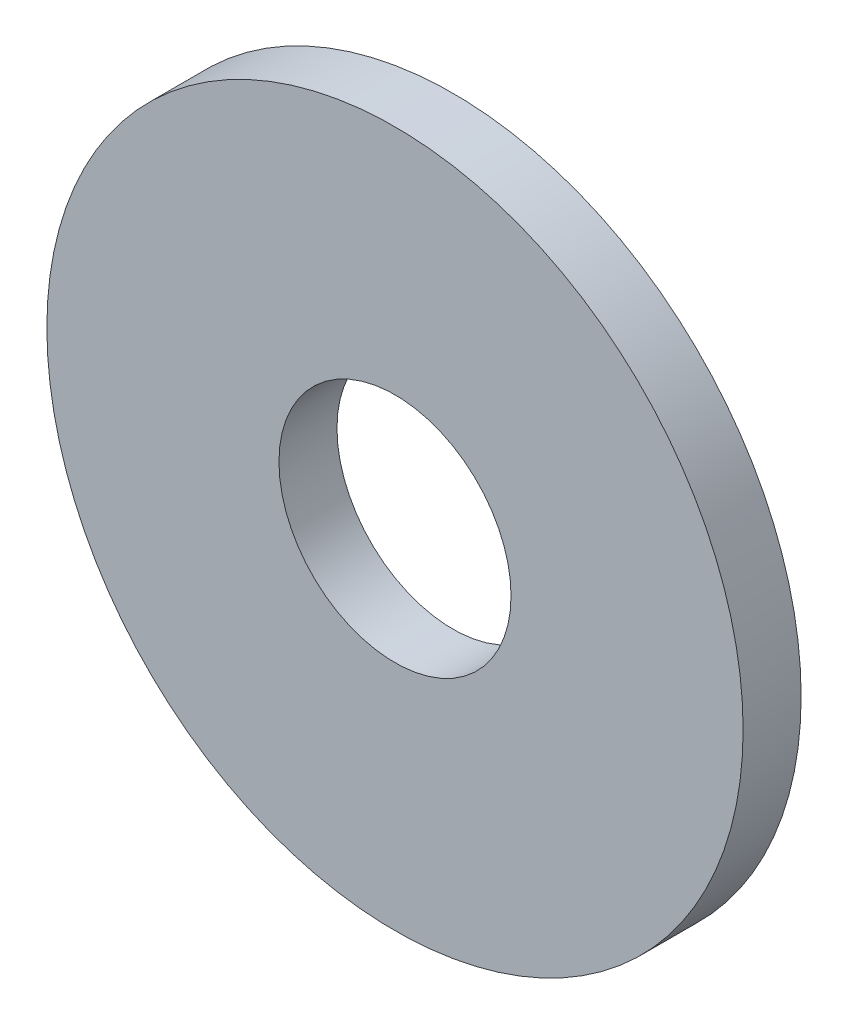
ISO-10303-21;
HEADER;
FILE_DESCRIPTION(('STEP AP214'),'2;1');
FILE_NAME('part.step','',(''),(''),'','','');
FILE_SCHEMA(('AUTOMOTIVE_DESIGN { 1 0 10303 214 1 1 1 1 }'));
ENDSEC;
DATA;
#1=APPLICATION_CONTEXT('core data for automotive mechanical design processes');
#2=APPLICATION_PROTOCOL_DEFINITION('international standard','automotive_design',2000,#1);
#3=PRODUCT_CONTEXT('',#1,'mechanical');
#4=PRODUCT('Part','Part','',(#3));
#5=PRODUCT_RELATED_PRODUCT_CATEGORY('part','',(#4));
#6=PRODUCT_DEFINITION_FORMATION('','',#4);
#7=PRODUCT_DEFINITION_CONTEXT('part definition',#1,'design');
#8=PRODUCT_DEFINITION('design','',#6,#7);
#9=PRODUCT_DEFINITION_SHAPE('','',#8);
#10=(LENGTH_UNIT() NAMED_UNIT(*) SI_UNIT(.MILLI.,.METRE.));
#11=(NAMED_UNIT(*) PLANE_ANGLE_UNIT() SI_UNIT($,.RADIAN.));
#12=(NAMED_UNIT(*) SI_UNIT($,.STERADIAN.) SOLID_ANGLE_UNIT());
#13=UNCERTAINTY_MEASURE_WITH_UNIT(LENGTH_MEASURE(1.E-05),#10,'distance_accuracy_value','');
#14=(GEOMETRIC_REPRESENTATION_CONTEXT(3) GLOBAL_UNCERTAINTY_ASSIGNED_CONTEXT((#13)) GLOBAL_UNIT_ASSIGNED_CONTEXT((#10,
#11,#12)) REPRESENTATION_CONTEXT('',''));
#15=CARTESIAN_POINT('',(0.,0.,0.));
#16=DIRECTION('',(0.,0.,1.));
#17=DIRECTION('',(1.,0.,0.));
#18=AXIS2_PLACEMENT_3D('',#15,#16,#17);
#19=CARTESIAN_POINT('',(6.2999997285072,6.2999993565615,-1.));
#20=DIRECTION('',(0.,0.,-1.));
#21=DIRECTION('',(0.,-1.,0.));
#22=AXIS2_PLACEMENT_3D('',#19,#20,#21);
#23=PLANE('',#22);
#24=CARTESIAN_POINT('',(0.,0.,-1.));
#25=DIRECTION('',(0.,0.,-1.));
#26=DIRECTION('',(-1.,0.,0.));
#27=AXIS2_PLACEMENT_3D('',#24,#25,#26);
#28=CIRCLE('',#27,2.);
#29=CARTESIAN_POINT('',(-1.99999999999998,0.,-1.));
#30=VERTEX_POINT('',#29);
#31=EDGE_CURVE('E28',#30,#30,#28,.T.);
#32=ORIENTED_EDGE('',*,*,#31,.F.);
#33=EDGE_LOOP('',(#32));
#34=FACE_BOUND('',#33,.T.);
#35=CARTESIAN_POINT('',(0.,0.,-1.));
#36=DIRECTION('',(0.,0.,-1.));
#37=DIRECTION('',(-1.,0.,0.));
#38=AXIS2_PLACEMENT_3D('',#35,#36,#37);
#39=CIRCLE('',#38,5.99999999999999);
#40=CARTESIAN_POINT('',(-6.00000000000003,0.,-1.));
#41=VERTEX_POINT('',#40);
#42=EDGE_CURVE('E19',#41,#41,#39,.F.);
#43=ORIENTED_EDGE('',*,*,#42,.F.);
#44=EDGE_LOOP('',(#43));
#45=FACE_BOUND('',#44,.T.);
#46=ADVANCED_FACE('F15',(#34,#45),#23,.T.);
#47=CARTESIAN_POINT('',(0.,0.,0.));
#48=DIRECTION('',(0.,0.,-1.));
#49=DIRECTION('',(-1.,0.,0.));
#50=AXIS2_PLACEMENT_3D('',#47,#48,#49);
#51=CYLINDRICAL_SURFACE('',#50,5.99999999999999);
#52=ORIENTED_EDGE('',*,*,#42,.T.);
#53=EDGE_LOOP('',(#52));
#54=FACE_BOUND('',#53,.T.);
#55=CARTESIAN_POINT('',(0.,0.,0.));
#56=DIRECTION('',(0.,0.,-1.));
#57=DIRECTION('',(-1.,0.,0.));
#58=AXIS2_PLACEMENT_3D('',#55,#56,#57);
#59=CIRCLE('',#58,5.99999999999999);
#60=CARTESIAN_POINT('',(-6.00000000000003,0.,0.));
#61=VERTEX_POINT('',#60);
#62=EDGE_CURVE('E23',#61,#61,#59,.F.);
#63=ORIENTED_EDGE('',*,*,#62,.F.);
#64=EDGE_LOOP('',(#63));
#65=FACE_BOUND('',#64,.T.);
#66=ADVANCED_FACE('F36',(#54,#65),#51,.T.);
#67=CARTESIAN_POINT('',(0.,0.,0.));
#68=DIRECTION('',(0.,0.,-1.));
#69=DIRECTION('',(-1.,0.,0.));
#70=AXIS2_PLACEMENT_3D('',#67,#68,#69);
#71=CYLINDRICAL_SURFACE('',#70,2.);
#72=ORIENTED_EDGE('',*,*,#31,.T.);
#73=EDGE_LOOP('',(#72));
#74=FACE_BOUND('',#73,.T.);
#75=CARTESIAN_POINT('',(0.,0.,0.));
#76=DIRECTION('',(0.,0.,-1.));
#77=DIRECTION('',(-1.,0.,0.));
#78=AXIS2_PLACEMENT_3D('',#75,#76,#77);
#79=CIRCLE('',#78,2.);
#80=CARTESIAN_POINT('',(-1.99999999999998,0.,0.));
#81=VERTEX_POINT('',#80);
#82=EDGE_CURVE('E10',#81,#81,#79,.T.);
#83=ORIENTED_EDGE('',*,*,#82,.F.);
#84=EDGE_LOOP('',(#83));
#85=FACE_BOUND('',#84,.T.);
#86=ADVANCED_FACE('F46',(#74,#85),#71,.F.);
#87=CARTESIAN_POINT('',(-6.2999993565615,-6.2999997285072,0.));
#88=DIRECTION('',(0.,0.,1.));
#89=DIRECTION('',(1.,0.,0.));
#90=AXIS2_PLACEMENT_3D('',#87,#88,#89);
#91=PLANE('',#90);
#92=ORIENTED_EDGE('',*,*,#82,.T.);
#93=EDGE_LOOP('',(#92));
#94=FACE_BOUND('',#93,.T.);
#95=ORIENTED_EDGE('',*,*,#62,.T.);
#96=EDGE_LOOP('',(#95));
#97=FACE_BOUND('',#96,.T.);
#98=ADVANCED_FACE('F17',(#94,#97),#91,.T.);
#99=CLOSED_SHELL('',(#46,#66,#86,#98));
#100=MANIFOLD_SOLID_BREP('B1',#99);
#101=ADVANCED_BREP_SHAPE_REPRESENTATION('',(#18,#100),#14);
#102=SHAPE_DEFINITION_REPRESENTATION(#9,#101);
ENDSEC;
END-ISO-10303-21;
